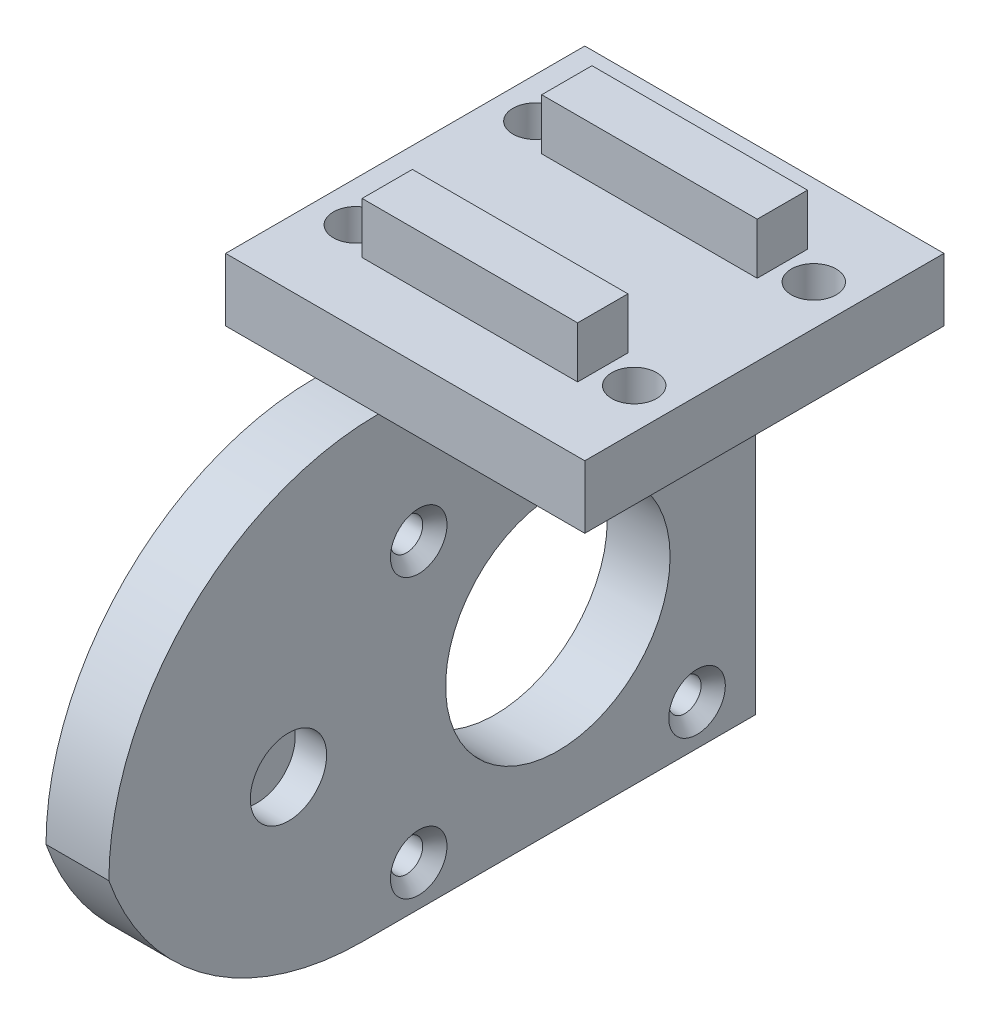
ISO-10303-21;
HEADER;
FILE_DESCRIPTION(('STEP AP214'),'2;1');
FILE_NAME('part.step','',(''),(''),'','','');
FILE_SCHEMA(('AUTOMOTIVE_DESIGN { 1 0 10303 214 1 1 1 1 }'));
ENDSEC;
DATA;
#1=APPLICATION_CONTEXT('core data for automotive mechanical design processes');
#2=APPLICATION_PROTOCOL_DEFINITION('international standard','automotive_design',2000,#1);
#3=PRODUCT_CONTEXT('',#1,'mechanical');
#4=PRODUCT('Part','Part','',(#3));
#5=PRODUCT_RELATED_PRODUCT_CATEGORY('part','',(#4));
#6=PRODUCT_DEFINITION_FORMATION('','',#4);
#7=PRODUCT_DEFINITION_CONTEXT('part definition',#1,'design');
#8=PRODUCT_DEFINITION('design','',#6,#7);
#9=PRODUCT_DEFINITION_SHAPE('','',#8);
#10=(LENGTH_UNIT() NAMED_UNIT(*) SI_UNIT(.MILLI.,.METRE.));
#11=(NAMED_UNIT(*) PLANE_ANGLE_UNIT() SI_UNIT($,.RADIAN.));
#12=(NAMED_UNIT(*) SI_UNIT($,.STERADIAN.) SOLID_ANGLE_UNIT());
#13=UNCERTAINTY_MEASURE_WITH_UNIT(LENGTH_MEASURE(1.E-05),#10,'distance_accuracy_value','');
#14=(GEOMETRIC_REPRESENTATION_CONTEXT(3) GLOBAL_UNCERTAINTY_ASSIGNED_CONTEXT((#13)) GLOBAL_UNIT_ASSIGNED_CONTEXT((#10,
#11,#12)) REPRESENTATION_CONTEXT('',''));
#15=CARTESIAN_POINT('',(0.,0.,0.));
#16=DIRECTION('',(0.,0.,1.));
#17=DIRECTION('',(1.,0.,0.));
#18=AXIS2_PLACEMENT_3D('',#15,#16,#17);
#19=CARTESIAN_POINT('',(0.,0.,0.));
#20=DIRECTION('',(0.,-1.,0.));
#21=DIRECTION('',(0.,0.,-1.));
#22=AXIS2_PLACEMENT_3D('',#19,#20,#21);
#23=PLANE('',#22);
#24=DIRECTION('',(0.,0.,-1.));
#25=VECTOR('',#24,1.);
#26=CARTESIAN_POINT('',(-10.,0.,50.));
#27=LINE('',#26,#25);
#28=CARTESIAN_POINT('',(-10.,0.,20.));
#29=VERTEX_POINT('',#28);
#30=CARTESIAN_POINT('',(-10.,0.,-20.));
#31=VERTEX_POINT('',#30);
#32=EDGE_CURVE('E324',#29,#31,#27,.T.);
#33=ORIENTED_EDGE('',*,*,#32,.F.);
#34=DIRECTION('',(1.,0.,0.));
#35=VECTOR('',#34,1.);
#36=CARTESIAN_POINT('',(20.,0.,20.));
#37=LINE('',#36,#35);
#38=CARTESIAN_POINT('',(-20.,0.,20.));
#39=VERTEX_POINT('',#38);
#40=EDGE_CURVE('E275',#39,#29,#37,.T.);
#41=ORIENTED_EDGE('',*,*,#40,.F.);
#42=DIRECTION('',(0.,0.,1.));
#43=VECTOR('',#42,1.);
#44=CARTESIAN_POINT('',(-20.,0.,-20.));
#45=LINE('',#44,#43);
#46=CARTESIAN_POINT('',(-20.,0.,-20.));
#47=VERTEX_POINT('',#46);
#48=EDGE_CURVE('E253',#47,#39,#45,.T.);
#49=ORIENTED_EDGE('',*,*,#48,.F.);
#50=DIRECTION('',(-1.,0.,0.));
#51=VECTOR('',#50,1.);
#52=CARTESIAN_POINT('',(20.,0.,-20.));
#53=LINE('',#52,#51);
#54=EDGE_CURVE('E281',#31,#47,#53,.T.);
#55=ORIENTED_EDGE('',*,*,#54,.F.);
#56=EDGE_LOOP('',(#33,#41,#49,#55));
#57=FACE_BOUND('',#56,.T.);
#58=CARTESIAN_POINT('',(-15.5,0.,-10.));
#59=DIRECTION('',(0.,-1.,0.));
#60=DIRECTION('',(0.,0.,-1.));
#61=AXIS2_PLACEMENT_3D('',#58,#59,#60);
#62=CIRCLE('',#61,2.5);
#63=CARTESIAN_POINT('',(-15.5,0.,-12.5));
#64=VERTEX_POINT('',#63);
#65=EDGE_CURVE('E208',#64,#64,#62,.F.);
#66=ORIENTED_EDGE('',*,*,#65,.T.);
#67=EDGE_LOOP('',(#66));
#68=FACE_BOUND('',#67,.T.);
#69=CARTESIAN_POINT('',(-15.5,0.,10.));
#70=DIRECTION('',(0.,-1.,0.));
#71=DIRECTION('',(0.,0.,-1.));
#72=AXIS2_PLACEMENT_3D('',#69,#70,#71);
#73=CIRCLE('',#72,2.5);
#74=CARTESIAN_POINT('',(-15.5,0.,7.50000000000001));
#75=VERTEX_POINT('',#74);
#76=EDGE_CURVE('E186',#75,#75,#73,.F.);
#77=ORIENTED_EDGE('',*,*,#76,.T.);
#78=EDGE_LOOP('',(#77));
#79=FACE_BOUND('',#78,.T.);
#80=ADVANCED_FACE('F37',(#57,#68,#79),#23,.T.);
#81=CARTESIAN_POINT('',(-20.,7.,-20.));
#82=DIRECTION('',(1.,0.,0.));
#83=DIRECTION('',(0.,0.,-1.));
#84=AXIS2_PLACEMENT_3D('',#81,#82,#83);
#85=PLANE('',#84);
#86=DIRECTION('',(0.,-1.,0.));
#87=VECTOR('',#86,1.);
#88=CARTESIAN_POINT('',(-20.,7.,20.));
#89=LINE('',#88,#87);
#90=CARTESIAN_POINT('',(-20.,7.,20.));
#91=VERTEX_POINT('',#90);
#92=EDGE_CURVE('E293',#91,#39,#89,.T.);
#93=ORIENTED_EDGE('',*,*,#92,.F.);
#94=DIRECTION('',(0.,0.,1.));
#95=VECTOR('',#94,1.);
#96=CARTESIAN_POINT('',(-20.,7.,-20.));
#97=LINE('',#96,#95);
#98=CARTESIAN_POINT('',(-20.,7.,-20.));
#99=VERTEX_POINT('',#98);
#100=EDGE_CURVE('E262',#99,#91,#97,.T.);
#101=ORIENTED_EDGE('',*,*,#100,.F.);
#102=DIRECTION('',(0.,-1.,0.));
#103=VECTOR('',#102,1.);
#104=CARTESIAN_POINT('',(-20.,7.,-20.));
#105=LINE('',#104,#103);
#106=EDGE_CURVE('E271',#99,#47,#105,.T.);
#107=ORIENTED_EDGE('',*,*,#106,.T.);
#108=ORIENTED_EDGE('',*,*,#48,.T.);
#109=EDGE_LOOP('',(#93,#101,#107,#108));
#110=FACE_BOUND('',#109,.T.);
#111=ADVANCED_FACE('F341',(#110),#85,.F.);
#112=CARTESIAN_POINT('',(20.,7.,20.));
#113=DIRECTION('',(0.,0.,-1.));
#114=DIRECTION('',(-1.,0.,0.));
#115=AXIS2_PLACEMENT_3D('',#112,#113,#114);
#116=PLANE('',#115);
#117=ORIENTED_EDGE('',*,*,#40,.T.);
#118=CARTESIAN_POINT('',(-3.00000000000001,0.,20.));
#119=VERTEX_POINT('',#118);
#120=EDGE_CURVE('E279',#29,#119,#37,.T.);
#121=ORIENTED_EDGE('',*,*,#120,.T.);
#122=CARTESIAN_POINT('',(20.,0.,20.));
#123=VERTEX_POINT('',#122);
#124=EDGE_CURVE('E274',#119,#123,#37,.T.);
#125=ORIENTED_EDGE('',*,*,#124,.T.);
#126=DIRECTION('',(0.,-1.,0.));
#127=VECTOR('',#126,1.);
#128=CARTESIAN_POINT('',(20.,7.,20.));
#129=LINE('',#128,#127);
#130=CARTESIAN_POINT('',(20.,7.,20.));
#131=VERTEX_POINT('',#130);
#132=EDGE_CURVE('E290',#131,#123,#129,.T.);
#133=ORIENTED_EDGE('',*,*,#132,.F.);
#134=DIRECTION('',(1.,0.,0.));
#135=VECTOR('',#134,1.);
#136=CARTESIAN_POINT('',(20.,7.,20.));
#137=LINE('',#136,#135);
#138=EDGE_CURVE('E264',#91,#131,#137,.T.);
#139=ORIENTED_EDGE('',*,*,#138,.F.);
#140=ORIENTED_EDGE('',*,*,#92,.T.);
#141=EDGE_LOOP('',(#117,#121,#125,#133,#139,#140));
#142=FACE_BOUND('',#141,.T.);
#143=ADVANCED_FACE('F348',(#142),#116,.F.);
#144=CARTESIAN_POINT('',(20.,7.,-20.));
#145=DIRECTION('',(-1.,0.,0.));
#146=DIRECTION('',(0.,0.,1.));
#147=AXIS2_PLACEMENT_3D('',#144,#145,#146);
#148=PLANE('',#147);
#149=DIRECTION('',(0.,-1.,0.));
#150=VECTOR('',#149,1.);
#151=CARTESIAN_POINT('',(20.,7.,-20.));
#152=LINE('',#151,#150);
#153=CARTESIAN_POINT('',(20.,7.,-20.));
#154=VERTEX_POINT('',#153);
#155=CARTESIAN_POINT('',(20.,0.,-20.));
#156=VERTEX_POINT('',#155);
#157=EDGE_CURVE('E287',#154,#156,#152,.T.);
#158=ORIENTED_EDGE('',*,*,#157,.F.);
#159=DIRECTION('',(0.,0.,-1.));
#160=VECTOR('',#159,1.);
#161=CARTESIAN_POINT('',(20.,7.,-20.));
#162=LINE('',#161,#160);
#163=EDGE_CURVE('E267',#131,#154,#162,.T.);
#164=ORIENTED_EDGE('',*,*,#163,.F.);
#165=ORIENTED_EDGE('',*,*,#132,.T.);
#166=DIRECTION('',(0.,0.,-1.));
#167=VECTOR('',#166,1.);
#168=CARTESIAN_POINT('',(20.,0.,-20.));
#169=LINE('',#168,#167);
#170=EDGE_CURVE('E278',#123,#156,#169,.T.);
#171=ORIENTED_EDGE('',*,*,#170,.T.);
#172=EDGE_LOOP('',(#158,#164,#165,#171));
#173=FACE_BOUND('',#172,.T.);
#174=ADVANCED_FACE('F490',(#173),#148,.F.);
#175=CARTESIAN_POINT('',(20.,7.,-20.));
#176=DIRECTION('',(0.,0.,1.));
#177=DIRECTION('',(1.,0.,0.));
#178=AXIS2_PLACEMENT_3D('',#175,#176,#177);
#179=PLANE('',#178);
#180=CARTESIAN_POINT('',(-3.00000000000001,0.,-20.));
#181=VERTEX_POINT('',#180);
#182=EDGE_CURVE('E265',#156,#181,#53,.T.);
#183=ORIENTED_EDGE('',*,*,#182,.T.);
#184=EDGE_CURVE('E284',#181,#31,#53,.T.);
#185=ORIENTED_EDGE('',*,*,#184,.T.);
#186=ORIENTED_EDGE('',*,*,#54,.T.);
#187=ORIENTED_EDGE('',*,*,#106,.F.);
#188=DIRECTION('',(-1.,0.,0.));
#189=VECTOR('',#188,1.);
#190=CARTESIAN_POINT('',(20.,7.,-20.));
#191=LINE('',#190,#189);
#192=EDGE_CURVE('E269',#154,#99,#191,.T.);
#193=ORIENTED_EDGE('',*,*,#192,.F.);
#194=ORIENTED_EDGE('',*,*,#157,.T.);
#195=EDGE_LOOP('',(#183,#185,#186,#187,#193,#194));
#196=FACE_BOUND('',#195,.T.);
#197=ADVANCED_FACE('F365',(#196),#179,.F.);
#198=CARTESIAN_POINT('',(0.,7.,0.));
#199=DIRECTION('',(0.,-1.,0.));
#200=DIRECTION('',(0.,0.,-1.));
#201=AXIS2_PLACEMENT_3D('',#198,#199,#200);
#202=PLANE('',#201);
#203=CARTESIAN_POINT('',(-15.5,7.,10.));
#204=DIRECTION('',(0.,1.,0.));
#205=DIRECTION('',(0.,0.,1.));
#206=AXIS2_PLACEMENT_3D('',#203,#204,#205);
#207=CIRCLE('',#206,2.5);
#208=CARTESIAN_POINT('',(-15.5,7.,12.5));
#209=VERTEX_POINT('',#208);
#210=EDGE_CURVE('E183',#209,#209,#207,.T.);
#211=ORIENTED_EDGE('',*,*,#210,.F.);
#212=EDGE_LOOP('',(#211));
#213=FACE_BOUND('',#212,.T.);
#214=CARTESIAN_POINT('',(15.5,7.,10.));
#215=DIRECTION('',(0.,1.,0.));
#216=DIRECTION('',(0.,0.,1.));
#217=AXIS2_PLACEMENT_3D('',#214,#215,#216);
#218=CIRCLE('',#217,2.5);
#219=CARTESIAN_POINT('',(15.5,7.,12.5));
#220=VERTEX_POINT('',#219);
#221=EDGE_CURVE('E199',#220,#220,#218,.T.);
#222=ORIENTED_EDGE('',*,*,#221,.F.);
#223=EDGE_LOOP('',(#222));
#224=FACE_BOUND('',#223,.T.);
#225=CARTESIAN_POINT('',(15.5,7.,-10.));
#226=DIRECTION('',(0.,1.,0.));
#227=DIRECTION('',(0.,0.,1.));
#228=AXIS2_PLACEMENT_3D('',#225,#226,#227);
#229=CIRCLE('',#228,2.49999999999999);
#230=CARTESIAN_POINT('',(15.5,7.,-7.5));
#231=VERTEX_POINT('',#230);
#232=EDGE_CURVE('E191',#231,#231,#229,.T.);
#233=ORIENTED_EDGE('',*,*,#232,.F.);
#234=EDGE_LOOP('',(#233));
#235=FACE_BOUND('',#234,.T.);
#236=CARTESIAN_POINT('',(-15.5,7.,-10.));
#237=DIRECTION('',(0.,1.,0.));
#238=DIRECTION('',(0.,0.,1.));
#239=AXIS2_PLACEMENT_3D('',#236,#237,#238);
#240=CIRCLE('',#239,2.5);
#241=CARTESIAN_POINT('',(-15.5,7.,-7.5));
#242=VERTEX_POINT('',#241);
#243=EDGE_CURVE('E198',#242,#242,#240,.T.);
#244=ORIENTED_EDGE('',*,*,#243,.F.);
#245=EDGE_LOOP('',(#244));
#246=FACE_BOUND('',#245,.T.);
#247=DIRECTION('',(0.,0.,-1.));
#248=VECTOR('',#247,1.);
#249=CARTESIAN_POINT('',(-12.,7.,-20.));
#250=LINE('',#249,#248);
#251=CARTESIAN_POINT('',(-12.,7.,12.8));
#252=VERTEX_POINT('',#251);
#253=CARTESIAN_POINT('',(-12.,7.,7.2));
#254=VERTEX_POINT('',#253);
#255=EDGE_CURVE('E219',#252,#254,#250,.T.);
#256=ORIENTED_EDGE('',*,*,#255,.T.);
#257=DIRECTION('',(-1.,0.,0.));
#258=VECTOR('',#257,1.);
#259=CARTESIAN_POINT('',(27.9906195003892,7.,7.19999999999999));
#260=LINE('',#259,#258);
#261=CARTESIAN_POINT('',(12.,7.,7.19999999999999));
#262=VERTEX_POINT('',#261);
#263=EDGE_CURVE('E237',#262,#254,#260,.T.);
#264=ORIENTED_EDGE('',*,*,#263,.F.);
#265=DIRECTION('',(0.,0.,1.));
#266=VECTOR('',#265,1.);
#267=CARTESIAN_POINT('',(12.,7.,-20.));
#268=LINE('',#267,#266);
#269=CARTESIAN_POINT('',(12.,7.,12.8));
#270=VERTEX_POINT('',#269);
#271=EDGE_CURVE('E222',#262,#270,#268,.T.);
#272=ORIENTED_EDGE('',*,*,#271,.T.);
#273=DIRECTION('',(-1.,0.,0.));
#274=VECTOR('',#273,1.);
#275=CARTESIAN_POINT('',(27.9906195003892,7.,12.8));
#276=LINE('',#275,#274);
#277=EDGE_CURVE('E245',#270,#252,#276,.T.);
#278=ORIENTED_EDGE('',*,*,#277,.T.);
#279=EDGE_LOOP('',(#256,#264,#272,#278));
#280=FACE_BOUND('',#279,.T.);
#281=CARTESIAN_POINT('',(-12.,7.,-7.2));
#282=VERTEX_POINT('',#281);
#283=CARTESIAN_POINT('',(-12.,7.,-12.8));
#284=VERTEX_POINT('',#283);
#285=EDGE_CURVE('E216',#282,#284,#250,.T.);
#286=ORIENTED_EDGE('',*,*,#285,.T.);
#287=DIRECTION('',(-1.,0.,0.));
#288=VECTOR('',#287,1.);
#289=CARTESIAN_POINT('',(27.9906195003892,7.,-12.8));
#290=LINE('',#289,#288);
#291=CARTESIAN_POINT('',(12.,7.,-12.8));
#292=VERTEX_POINT('',#291);
#293=EDGE_CURVE('E254',#292,#284,#290,.T.);
#294=ORIENTED_EDGE('',*,*,#293,.F.);
#295=CARTESIAN_POINT('',(12.,7.,-7.20000000000001));
#296=VERTEX_POINT('',#295);
#297=EDGE_CURVE('E215',#292,#296,#268,.T.);
#298=ORIENTED_EDGE('',*,*,#297,.T.);
#299=DIRECTION('',(-1.,0.,0.));
#300=VECTOR('',#299,1.);
#301=CARTESIAN_POINT('',(27.9906195003892,7.,-7.20000000000001));
#302=LINE('',#301,#300);
#303=EDGE_CURVE('E250',#296,#282,#302,.T.);
#304=ORIENTED_EDGE('',*,*,#303,.T.);
#305=EDGE_LOOP('',(#286,#294,#298,#304));
#306=FACE_BOUND('',#305,.T.);
#307=ORIENTED_EDGE('',*,*,#192,.T.);
#308=ORIENTED_EDGE('',*,*,#100,.T.);
#309=ORIENTED_EDGE('',*,*,#138,.T.);
#310=ORIENTED_EDGE('',*,*,#163,.T.);
#311=EDGE_LOOP('',(#307,#308,#309,#310));
#312=FACE_BOUND('',#311,.T.);
#313=ADVANCED_FACE('F356',(#213,#224,#235,#246,#280,#306,#312),#202,.F.);
#314=DIRECTION('',(0.,0.,1.));
#315=VECTOR('',#314,1.);
#316=CARTESIAN_POINT('',(-3.00000000000001,0.,50.));
#317=LINE('',#316,#315);
#318=EDGE_CURVE('E300',#181,#119,#317,.T.);
#319=ORIENTED_EDGE('',*,*,#318,.F.);
#320=ORIENTED_EDGE('',*,*,#182,.F.);
#321=ORIENTED_EDGE('',*,*,#170,.F.);
#322=ORIENTED_EDGE('',*,*,#124,.F.);
#323=EDGE_LOOP('',(#319,#320,#321,#322));
#324=FACE_BOUND('',#323,.T.);
#325=CARTESIAN_POINT('',(15.5,0.,10.));
#326=DIRECTION('',(0.,-1.,0.));
#327=DIRECTION('',(0.,0.,-1.));
#328=AXIS2_PLACEMENT_3D('',#325,#326,#327);
#329=CIRCLE('',#328,2.5);
#330=CARTESIAN_POINT('',(15.5,0.,7.50000000000001));
#331=VERTEX_POINT('',#330);
#332=EDGE_CURVE('E195',#331,#331,#329,.F.);
#333=ORIENTED_EDGE('',*,*,#332,.T.);
#334=EDGE_LOOP('',(#333));
#335=FACE_BOUND('',#334,.T.);
#336=CARTESIAN_POINT('',(15.5,0.,-10.));
#337=DIRECTION('',(0.,-1.,0.));
#338=DIRECTION('',(0.,0.,-1.));
#339=AXIS2_PLACEMENT_3D('',#336,#337,#338);
#340=CIRCLE('',#339,2.49999999999999);
#341=CARTESIAN_POINT('',(15.5,0.,-12.5));
#342=VERTEX_POINT('',#341);
#343=EDGE_CURVE('E194',#342,#342,#340,.F.);
#344=ORIENTED_EDGE('',*,*,#343,.T.);
#345=EDGE_LOOP('',(#344));
#346=FACE_BOUND('',#345,.T.);
#347=ADVANCED_FACE('F344',(#324,#335,#346),#23,.T.);
#348=CARTESIAN_POINT('',(27.9906195003892,7.,-7.20000000000001));
#349=DIRECTION('',(0.,0.,1.));
#350=DIRECTION('',(1.,0.,0.));
#351=AXIS2_PLACEMENT_3D('',#348,#349,#350);
#352=PLANE('',#351);
#353=DIRECTION('',(0.,1.,0.));
#354=VECTOR('',#353,1.);
#355=CARTESIAN_POINT('',(-12.,7.,-7.2));
#356=LINE('',#355,#354);
#357=CARTESIAN_POINT('',(-12.,12.7,-7.2));
#358=VERTEX_POINT('',#357);
#359=EDGE_CURVE('E235',#282,#358,#356,.T.);
#360=ORIENTED_EDGE('',*,*,#359,.F.);
#361=ORIENTED_EDGE('',*,*,#303,.F.);
#362=DIRECTION('',(0.,-1.,0.));
#363=VECTOR('',#362,1.);
#364=CARTESIAN_POINT('',(12.,7.,-7.20000000000001));
#365=LINE('',#364,#363);
#366=CARTESIAN_POINT('',(12.,12.7,-7.2));
#367=VERTEX_POINT('',#366);
#368=EDGE_CURVE('E229',#367,#296,#365,.T.);
#369=ORIENTED_EDGE('',*,*,#368,.F.);
#370=DIRECTION('',(-1.,0.,0.));
#371=VECTOR('',#370,1.);
#372=CARTESIAN_POINT('',(27.9906195003892,12.7,-7.20000000000001));
#373=LINE('',#372,#371);
#374=EDGE_CURVE('E241',#367,#358,#373,.T.);
#375=ORIENTED_EDGE('',*,*,#374,.T.);
#376=EDGE_LOOP('',(#360,#361,#369,#375));
#377=FACE_BOUND('',#376,.T.);
#378=ADVANCED_FACE('F355',(#377),#352,.T.);
#379=CARTESIAN_POINT('',(27.9906195003892,7.,-12.8));
#380=DIRECTION('',(0.,0.,-1.));
#381=DIRECTION('',(0.,1.,0.));
#382=AXIS2_PLACEMENT_3D('',#379,#380,#381);
#383=PLANE('',#382);
#384=DIRECTION('',(0.,-1.,0.));
#385=VECTOR('',#384,1.);
#386=CARTESIAN_POINT('',(-12.,7.,-12.8));
#387=LINE('',#386,#385);
#388=CARTESIAN_POINT('',(-12.,12.7,-12.8));
#389=VERTEX_POINT('',#388);
#390=EDGE_CURVE('E233',#389,#284,#387,.T.);
#391=ORIENTED_EDGE('',*,*,#390,.F.);
#392=DIRECTION('',(-1.,0.,0.));
#393=VECTOR('',#392,1.);
#394=CARTESIAN_POINT('',(27.9906195003892,12.7,-12.8));
#395=LINE('',#394,#393);
#396=CARTESIAN_POINT('',(12.,12.7,-12.8));
#397=VERTEX_POINT('',#396);
#398=EDGE_CURVE('E257',#397,#389,#395,.T.);
#399=ORIENTED_EDGE('',*,*,#398,.F.);
#400=DIRECTION('',(0.,1.,0.));
#401=VECTOR('',#400,1.);
#402=CARTESIAN_POINT('',(12.,7.,-12.8));
#403=LINE('',#402,#401);
#404=EDGE_CURVE('E227',#292,#397,#403,.T.);
#405=ORIENTED_EDGE('',*,*,#404,.F.);
#406=ORIENTED_EDGE('',*,*,#293,.T.);
#407=EDGE_LOOP('',(#391,#399,#405,#406));
#408=FACE_BOUND('',#407,.T.);
#409=ADVANCED_FACE('F362',(#408),#383,.T.);
#410=CARTESIAN_POINT('',(27.9906195003892,12.7,-7.20000000000001));
#411=DIRECTION('',(0.,1.,0.));
#412=DIRECTION('',(0.,0.,1.));
#413=AXIS2_PLACEMENT_3D('',#410,#411,#412);
#414=PLANE('',#413);
#415=DIRECTION('',(0.,0.,-1.));
#416=VECTOR('',#415,1.);
#417=CARTESIAN_POINT('',(-12.,12.7,-20.));
#418=LINE('',#417,#416);
#419=EDGE_CURVE('E212',#358,#389,#418,.T.);
#420=ORIENTED_EDGE('',*,*,#419,.F.);
#421=ORIENTED_EDGE('',*,*,#374,.F.);
#422=DIRECTION('',(0.,0.,1.));
#423=VECTOR('',#422,1.);
#424=CARTESIAN_POINT('',(12.,12.7,-20.));
#425=LINE('',#424,#423);
#426=EDGE_CURVE('E221',#397,#367,#425,.T.);
#427=ORIENTED_EDGE('',*,*,#426,.F.);
#428=ORIENTED_EDGE('',*,*,#398,.T.);
#429=EDGE_LOOP('',(#420,#421,#427,#428));
#430=FACE_BOUND('',#429,.T.);
#431=ADVANCED_FACE('F418',(#430),#414,.T.);
#432=CARTESIAN_POINT('',(27.9906195003892,7.,7.19999999999999));
#433=DIRECTION('',(0.,0.,-1.));
#434=DIRECTION('',(-1.,0.,0.));
#435=AXIS2_PLACEMENT_3D('',#432,#433,#434);
#436=PLANE('',#435);
#437=DIRECTION('',(0.,-1.,0.));
#438=VECTOR('',#437,1.);
#439=CARTESIAN_POINT('',(-12.,7.,7.2));
#440=LINE('',#439,#438);
#441=CARTESIAN_POINT('',(-12.,12.7,7.19999999999999));
#442=VERTEX_POINT('',#441);
#443=EDGE_CURVE('E231',#442,#254,#440,.T.);
#444=ORIENTED_EDGE('',*,*,#443,.F.);
#445=DIRECTION('',(-1.,0.,0.));
#446=VECTOR('',#445,1.);
#447=CARTESIAN_POINT('',(27.9906195003892,12.7,7.19999999999999));
#448=LINE('',#447,#446);
#449=CARTESIAN_POINT('',(12.,12.7,7.19999999999999));
#450=VERTEX_POINT('',#449);
#451=EDGE_CURVE('E238',#450,#442,#448,.T.);
#452=ORIENTED_EDGE('',*,*,#451,.F.);
#453=DIRECTION('',(0.,1.,0.));
#454=VECTOR('',#453,1.);
#455=CARTESIAN_POINT('',(12.,7.,7.2));
#456=LINE('',#455,#454);
#457=EDGE_CURVE('E225',#262,#450,#456,.T.);
#458=ORIENTED_EDGE('',*,*,#457,.F.);
#459=ORIENTED_EDGE('',*,*,#263,.T.);
#460=EDGE_LOOP('',(#444,#452,#458,#459));
#461=FACE_BOUND('',#460,.T.);
#462=ADVANCED_FACE('F411',(#461),#436,.T.);
#463=CARTESIAN_POINT('',(27.9906195003892,12.7,7.19999999999999));
#464=DIRECTION('',(0.,1.,0.));
#465=DIRECTION('',(0.,0.,1.));
#466=AXIS2_PLACEMENT_3D('',#463,#464,#465);
#467=PLANE('',#466);
#468=CARTESIAN_POINT('',(-12.,12.7,12.8));
#469=VERTEX_POINT('',#468);
#470=EDGE_CURVE('E214',#469,#442,#418,.T.);
#471=ORIENTED_EDGE('',*,*,#470,.F.);
#472=DIRECTION('',(-1.,0.,0.));
#473=VECTOR('',#472,1.);
#474=CARTESIAN_POINT('',(27.9906195003892,12.7,12.8));
#475=LINE('',#474,#473);
#476=CARTESIAN_POINT('',(12.,12.7,12.8));
#477=VERTEX_POINT('',#476);
#478=EDGE_CURVE('E242',#477,#469,#475,.T.);
#479=ORIENTED_EDGE('',*,*,#478,.F.);
#480=EDGE_CURVE('E211',#450,#477,#425,.T.);
#481=ORIENTED_EDGE('',*,*,#480,.F.);
#482=ORIENTED_EDGE('',*,*,#451,.T.);
#483=EDGE_LOOP('',(#471,#479,#481,#482));
#484=FACE_BOUND('',#483,.T.);
#485=ADVANCED_FACE('F408',(#484),#467,.T.);
#486=CARTESIAN_POINT('',(27.9906195003892,7.,12.8));
#487=DIRECTION('',(0.,0.,1.));
#488=DIRECTION('',(1.,0.,0.));
#489=AXIS2_PLACEMENT_3D('',#486,#487,#488);
#490=PLANE('',#489);
#491=DIRECTION('',(0.,1.,0.));
#492=VECTOR('',#491,1.);
#493=CARTESIAN_POINT('',(-12.,7.,12.8));
#494=LINE('',#493,#492);
#495=EDGE_CURVE('E298',#252,#469,#494,.T.);
#496=ORIENTED_EDGE('',*,*,#495,.F.);
#497=ORIENTED_EDGE('',*,*,#277,.F.);
#498=DIRECTION('',(0.,-1.,0.));
#499=VECTOR('',#498,1.);
#500=CARTESIAN_POINT('',(12.,7.,12.8));
#501=LINE('',#500,#499);
#502=EDGE_CURVE('E296',#477,#270,#501,.T.);
#503=ORIENTED_EDGE('',*,*,#502,.F.);
#504=ORIENTED_EDGE('',*,*,#478,.T.);
#505=EDGE_LOOP('',(#496,#497,#503,#504));
#506=FACE_BOUND('',#505,.T.);
#507=ADVANCED_FACE('F406',(#506),#490,.T.);
#508=CARTESIAN_POINT('',(12.,-33.7921561087423,-20.));
#509=DIRECTION('',(-1.,0.,0.));
#510=DIRECTION('',(0.,0.,1.));
#511=AXIS2_PLACEMENT_3D('',#508,#509,#510);
#512=PLANE('',#511);
#513=ORIENTED_EDGE('',*,*,#457,.T.);
#514=ORIENTED_EDGE('',*,*,#480,.T.);
#515=ORIENTED_EDGE('',*,*,#502,.T.);
#516=ORIENTED_EDGE('',*,*,#271,.F.);
#517=EDGE_LOOP('',(#513,#514,#515,#516));
#518=FACE_BOUND('',#517,.T.);
#519=ADVANCED_FACE('F402',(#518),#512,.F.);
#520=CARTESIAN_POINT('',(-12.,-33.7921561087423,-20.));
#521=DIRECTION('',(1.,0.,0.));
#522=DIRECTION('',(0.,0.,-1.));
#523=AXIS2_PLACEMENT_3D('',#520,#521,#522);
#524=PLANE('',#523);
#525=ORIENTED_EDGE('',*,*,#443,.T.);
#526=ORIENTED_EDGE('',*,*,#255,.F.);
#527=ORIENTED_EDGE('',*,*,#495,.T.);
#528=ORIENTED_EDGE('',*,*,#470,.T.);
#529=EDGE_LOOP('',(#525,#526,#527,#528));
#530=FACE_BOUND('',#529,.T.);
#531=ADVANCED_FACE('F398',(#530),#524,.F.);
#532=ORIENTED_EDGE('',*,*,#368,.T.);
#533=ORIENTED_EDGE('',*,*,#297,.F.);
#534=ORIENTED_EDGE('',*,*,#404,.T.);
#535=ORIENTED_EDGE('',*,*,#426,.T.);
#536=EDGE_LOOP('',(#532,#533,#534,#535));
#537=FACE_BOUND('',#536,.T.);
#538=ADVANCED_FACE('F401',(#537),#512,.F.);
#539=ORIENTED_EDGE('',*,*,#359,.T.);
#540=ORIENTED_EDGE('',*,*,#419,.T.);
#541=ORIENTED_EDGE('',*,*,#390,.T.);
#542=ORIENTED_EDGE('',*,*,#285,.F.);
#543=EDGE_LOOP('',(#539,#540,#541,#542));
#544=FACE_BOUND('',#543,.T.);
#545=ADVANCED_FACE('F388',(#544),#524,.F.);
#546=CARTESIAN_POINT('',(-15.5,-7.07106781186548,-10.));
#547=DIRECTION('',(0.,1.,0.));
#548=DIRECTION('',(0.,0.,1.));
#549=AXIS2_PLACEMENT_3D('',#546,#547,#548);
#550=CYLINDRICAL_SURFACE('',#549,2.5);
#551=ORIENTED_EDGE('',*,*,#243,.T.);
#552=EDGE_LOOP('',(#551));
#553=FACE_BOUND('',#552,.T.);
#554=ORIENTED_EDGE('',*,*,#65,.F.);
#555=EDGE_LOOP('',(#554));
#556=FACE_BOUND('',#555,.T.);
#557=ADVANCED_FACE('F378',(#553,#556),#550,.F.);
#558=CARTESIAN_POINT('',(15.5,-7.07106781186548,-10.));
#559=DIRECTION('',(0.,1.,0.));
#560=DIRECTION('',(0.,0.,1.));
#561=AXIS2_PLACEMENT_3D('',#558,#559,#560);
#562=CYLINDRICAL_SURFACE('',#561,2.49999999999999);
#563=ORIENTED_EDGE('',*,*,#232,.T.);
#564=EDGE_LOOP('',(#563));
#565=FACE_BOUND('',#564,.T.);
#566=ORIENTED_EDGE('',*,*,#343,.F.);
#567=EDGE_LOOP('',(#566));
#568=FACE_BOUND('',#567,.T.);
#569=ADVANCED_FACE('F375',(#565,#568),#562,.F.);
#570=CARTESIAN_POINT('',(15.5,-7.07106781186548,10.));
#571=DIRECTION('',(0.,1.,0.));
#572=DIRECTION('',(0.,0.,1.));
#573=AXIS2_PLACEMENT_3D('',#570,#571,#572);
#574=CYLINDRICAL_SURFACE('',#573,2.5);
#575=ORIENTED_EDGE('',*,*,#221,.T.);
#576=EDGE_LOOP('',(#575));
#577=FACE_BOUND('',#576,.T.);
#578=ORIENTED_EDGE('',*,*,#332,.F.);
#579=EDGE_LOOP('',(#578));
#580=FACE_BOUND('',#579,.T.);
#581=ADVANCED_FACE('F377',(#577,#580),#574,.F.);
#582=CARTESIAN_POINT('',(-15.5,-7.07106781186548,10.));
#583=DIRECTION('',(0.,1.,0.));
#584=DIRECTION('',(0.,0.,1.));
#585=AXIS2_PLACEMENT_3D('',#582,#583,#584);
#586=CYLINDRICAL_SURFACE('',#585,2.5);
#587=ORIENTED_EDGE('',*,*,#210,.T.);
#588=EDGE_LOOP('',(#587));
#589=FACE_BOUND('',#588,.T.);
#590=ORIENTED_EDGE('',*,*,#76,.F.);
#591=EDGE_LOOP('',(#590));
#592=FACE_BOUND('',#591,.T.);
#593=ADVANCED_FACE('F385',(#589,#592),#586,.F.);
#594=CARTESIAN_POINT('',(0.,0.,0.));
#595=DIRECTION('',(0.,1.,0.));
#596=DIRECTION('',(0.,0.,1.));
#597=AXIS2_PLACEMENT_3D('',#594,#595,#596);
#598=PLANE('',#597);
#599=ORIENTED_EDGE('',*,*,#184,.F.);
#600=CARTESIAN_POINT('',(-3.,0.,-22.));
#601=VERTEX_POINT('',#600);
#602=EDGE_CURVE('E168',#601,#181,#317,.T.);
#603=ORIENTED_EDGE('',*,*,#602,.F.);
#604=DIRECTION('',(1.,0.,0.));
#605=VECTOR('',#604,1.);
#606=CARTESIAN_POINT('',(-3.,0.,-22.));
#607=LINE('',#606,#605);
#608=CARTESIAN_POINT('',(-10.,0.,-22.));
#609=VERTEX_POINT('',#608);
#610=EDGE_CURVE('E776',#609,#601,#607,.T.);
#611=ORIENTED_EDGE('',*,*,#610,.F.);
#612=EDGE_CURVE('E181',#31,#609,#27,.T.);
#613=ORIENTED_EDGE('',*,*,#612,.F.);
#614=EDGE_LOOP('',(#599,#603,#611,#613));
#615=FACE_BOUND('',#614,.T.);
#616=ADVANCED_FACE('F395',(#615),#598,.T.);
#617=CARTESIAN_POINT('',(-10.,-50.,50.));
#618=DIRECTION('',(1.,0.,0.));
#619=DIRECTION('',(0.,0.,-1.));
#620=AXIS2_PLACEMENT_3D('',#617,#618,#619);
#621=PLANE('',#620);
#622=CARTESIAN_POINT('',(-10.,-14.5,15.5));
#623=DIRECTION('',(1.,0.,0.));
#624=DIRECTION('',(0.,0.,-1.));
#625=AXIS2_PLACEMENT_3D('',#622,#623,#624);
#626=CIRCLE('',#625,1.8);
#627=CARTESIAN_POINT('',(-10.,-14.5,13.7));
#628=VERTEX_POINT('',#627);
#629=EDGE_CURVE('E316',#628,#628,#626,.T.);
#630=ORIENTED_EDGE('',*,*,#629,.T.);
#631=EDGE_LOOP('',(#630));
#632=FACE_BOUND('',#631,.T.);
#633=CARTESIAN_POINT('',(-10.,-14.5,-15.5));
#634=DIRECTION('',(1.,0.,0.));
#635=DIRECTION('',(0.,0.,-1.));
#636=AXIS2_PLACEMENT_3D('',#633,#634,#635);
#637=CIRCLE('',#636,1.8);
#638=CARTESIAN_POINT('',(-10.,-14.5,-17.3));
#639=VERTEX_POINT('',#638);
#640=EDGE_CURVE('E311',#639,#639,#637,.T.);
#641=ORIENTED_EDGE('',*,*,#640,.T.);
#642=EDGE_LOOP('',(#641));
#643=FACE_BOUND('',#642,.T.);
#644=CARTESIAN_POINT('',(-10.,-45.5,-15.5));
#645=DIRECTION('',(1.,0.,0.));
#646=DIRECTION('',(0.,0.,-1.));
#647=AXIS2_PLACEMENT_3D('',#644,#645,#646);
#648=CIRCLE('',#647,1.8);
#649=CARTESIAN_POINT('',(-10.,-45.5,-17.3));
#650=VERTEX_POINT('',#649);
#651=EDGE_CURVE('E306',#650,#650,#648,.T.);
#652=ORIENTED_EDGE('',*,*,#651,.T.);
#653=EDGE_LOOP('',(#652));
#654=FACE_BOUND('',#653,.T.);
#655=CARTESIAN_POINT('',(-10.,-45.5,15.5));
#656=DIRECTION('',(1.,0.,0.));
#657=DIRECTION('',(0.,0.,-1.));
#658=AXIS2_PLACEMENT_3D('',#655,#656,#657);
#659=CIRCLE('',#658,1.8);
#660=CARTESIAN_POINT('',(-10.,-45.5,13.7));
#661=VERTEX_POINT('',#660);
#662=EDGE_CURVE('E301',#661,#661,#659,.T.);
#663=ORIENTED_EDGE('',*,*,#662,.T.);
#664=EDGE_LOOP('',(#663));
#665=FACE_BOUND('',#664,.T.);
#666=CARTESIAN_POINT('',(-10.,-30.,0.));
#667=DIRECTION('',(1.,0.,0.));
#668=DIRECTION('',(0.,0.,-1.));
#669=AXIS2_PLACEMENT_3D('',#666,#667,#668);
#670=CIRCLE('',#669,12.5);
#671=CARTESIAN_POINT('',(-10.,-30.,-12.5));
#672=VERTEX_POINT('',#671);
#673=EDGE_CURVE('E780',#672,#672,#670,.F.);
#674=ORIENTED_EDGE('',*,*,#673,.F.);
#675=EDGE_LOOP('',(#674));
#676=FACE_BOUND('',#675,.T.);
#677=DIRECTION('',(0.,0.,-1.));
#678=VECTOR('',#677,1.);
#679=CARTESIAN_POINT('',(-10.,-50.,50.));
#680=LINE('',#679,#678);
#681=CARTESIAN_POINT('',(-10.,-50.,21.7157287525381));
#682=VERTEX_POINT('',#681);
#683=CARTESIAN_POINT('',(-10.,-50.,-22.));
#684=VERTEX_POINT('',#683);
#685=EDGE_CURVE('E160',#682,#684,#680,.T.);
#686=ORIENTED_EDGE('',*,*,#685,.F.);
#687=CARTESIAN_POINT('',(-10.,-20.,21.7157287525381));
#688=DIRECTION('',(1.,0.,0.));
#689=DIRECTION('',(0.,0.,-1.));
#690=AXIS2_PLACEMENT_3D('',#687,#688,#689);
#691=CIRCLE('',#690,30.);
#692=CARTESIAN_POINT('',(-10.,-30.,50.));
#693=VERTEX_POINT('',#692);
#694=EDGE_CURVE('E45',#682,#693,#691,.F.);
#695=ORIENTED_EDGE('',*,*,#694,.T.);
#696=CARTESIAN_POINT('',(-10.,-30.,20.));
#697=DIRECTION('',(1.,0.,0.));
#698=DIRECTION('',(0.,0.,-1.));
#699=AXIS2_PLACEMENT_3D('',#696,#697,#698);
#700=CIRCLE('',#699,30.);
#701=EDGE_CURVE('E323',#693,#29,#700,.F.);
#702=ORIENTED_EDGE('',*,*,#701,.T.);
#703=ORIENTED_EDGE('',*,*,#32,.T.);
#704=ORIENTED_EDGE('',*,*,#612,.T.);
#705=DIRECTION('',(0.,1.,0.));
#706=VECTOR('',#705,1.);
#707=CARTESIAN_POINT('',(-10.,-50.,-22.));
#708=LINE('',#707,#706);
#709=EDGE_CURVE('E173',#684,#609,#708,.T.);
#710=ORIENTED_EDGE('',*,*,#709,.F.);
#711=EDGE_LOOP('',(#686,#695,#702,#703,#704,#710));
#712=FACE_BOUND('',#711,.T.);
#713=ADVANCED_FACE('F178',(#632,#643,#654,#665,#676,#712),#621,.F.);
#714=CARTESIAN_POINT('',(-3.,-50.,-22.));
#715=DIRECTION('',(0.,0.,1.));
#716=DIRECTION('',(1.,0.,0.));
#717=AXIS2_PLACEMENT_3D('',#714,#715,#716);
#718=PLANE('',#717);
#719=ORIENTED_EDGE('',*,*,#610,.T.);
#720=DIRECTION('',(0.,1.,0.));
#721=VECTOR('',#720,1.);
#722=CARTESIAN_POINT('',(-3.,-50.,-22.));
#723=LINE('',#722,#721);
#724=CARTESIAN_POINT('',(-3.,-50.,-22.));
#725=VERTEX_POINT('',#724);
#726=EDGE_CURVE('E175',#725,#601,#723,.T.);
#727=ORIENTED_EDGE('',*,*,#726,.F.);
#728=DIRECTION('',(1.,0.,0.));
#729=VECTOR('',#728,1.);
#730=CARTESIAN_POINT('',(-3.,-50.,-22.));
#731=LINE('',#730,#729);
#732=EDGE_CURVE('E163',#684,#725,#731,.T.);
#733=ORIENTED_EDGE('',*,*,#732,.F.);
#734=ORIENTED_EDGE('',*,*,#709,.T.);
#735=EDGE_LOOP('',(#719,#727,#733,#734));
#736=FACE_BOUND('',#735,.T.);
#737=ADVANCED_FACE('F172',(#736),#718,.F.);
#738=CARTESIAN_POINT('',(-3.00000000000001,-50.,50.));
#739=DIRECTION('',(-1.,0.,0.));
#740=DIRECTION('',(0.,0.,1.));
#741=AXIS2_PLACEMENT_3D('',#738,#739,#740);
#742=PLANE('',#741);
#743=CARTESIAN_POINT('',(-3.00000000000001,-30.,30.));
#744=DIRECTION('',(1.,0.,0.));
#745=DIRECTION('',(0.,0.,-1.));
#746=AXIS2_PLACEMENT_3D('',#743,#744,#745);
#747=CIRCLE('',#746,4.25);
#748=CARTESIAN_POINT('',(-3.00000000000001,-30.,25.75));
#749=VERTEX_POINT('',#748);
#750=EDGE_CURVE('E805',#749,#749,#747,.T.);
#751=ORIENTED_EDGE('',*,*,#750,.F.);
#752=EDGE_LOOP('',(#751));
#753=FACE_BOUND('',#752,.T.);
#754=CARTESIAN_POINT('',(-3.00000000000001,-14.5,15.5));
#755=DIRECTION('',(1.,0.,0.));
#756=DIRECTION('',(0.,0.,-1.));
#757=AXIS2_PLACEMENT_3D('',#754,#755,#756);
#758=CIRCLE('',#757,3.15);
#759=CARTESIAN_POINT('',(-3.00000000000001,-14.5,12.35));
#760=VERTEX_POINT('',#759);
#761=EDGE_CURVE('E801',#760,#760,#758,.T.);
#762=ORIENTED_EDGE('',*,*,#761,.F.);
#763=EDGE_LOOP('',(#762));
#764=FACE_BOUND('',#763,.T.);
#765=CARTESIAN_POINT('',(-3.,-14.5,-15.5));
#766=DIRECTION('',(1.,0.,0.));
#767=DIRECTION('',(0.,0.,-1.));
#768=AXIS2_PLACEMENT_3D('',#765,#766,#767);
#769=CIRCLE('',#768,3.15);
#770=CARTESIAN_POINT('',(-3.,-14.5,-18.65));
#771=VERTEX_POINT('',#770);
#772=EDGE_CURVE('E319',#771,#771,#769,.T.);
#773=ORIENTED_EDGE('',*,*,#772,.F.);
#774=EDGE_LOOP('',(#773));
#775=FACE_BOUND('',#774,.T.);
#776=CARTESIAN_POINT('',(-3.,-45.5,-15.5));
#777=DIRECTION('',(1.,0.,0.));
#778=DIRECTION('',(0.,0.,-1.));
#779=AXIS2_PLACEMENT_3D('',#776,#777,#778);
#780=CIRCLE('',#779,3.15);
#781=CARTESIAN_POINT('',(-3.,-45.5,-18.65));
#782=VERTEX_POINT('',#781);
#783=EDGE_CURVE('E314',#782,#782,#780,.T.);
#784=ORIENTED_EDGE('',*,*,#783,.F.);
#785=EDGE_LOOP('',(#784));
#786=FACE_BOUND('',#785,.T.);
#787=CARTESIAN_POINT('',(-3.00000000000001,-45.5,15.5));
#788=DIRECTION('',(1.,0.,0.));
#789=DIRECTION('',(0.,0.,-1.));
#790=AXIS2_PLACEMENT_3D('',#787,#788,#789);
#791=CIRCLE('',#790,3.15);
#792=CARTESIAN_POINT('',(-3.00000000000001,-45.5,12.35));
#793=VERTEX_POINT('',#792);
#794=EDGE_CURVE('E309',#793,#793,#791,.T.);
#795=ORIENTED_EDGE('',*,*,#794,.F.);
#796=EDGE_LOOP('',(#795));
#797=FACE_BOUND('',#796,.T.);
#798=CARTESIAN_POINT('',(-3.00000000000001,-30.,0.));
#799=DIRECTION('',(1.,0.,0.));
#800=DIRECTION('',(0.,0.,-1.));
#801=AXIS2_PLACEMENT_3D('',#798,#799,#800);
#802=CIRCLE('',#801,12.5);
#803=CARTESIAN_POINT('',(-3.,-30.,-12.5));
#804=VERTEX_POINT('',#803);
#805=EDGE_CURVE('E304',#804,#804,#802,.T.);
#806=ORIENTED_EDGE('',*,*,#805,.F.);
#807=EDGE_LOOP('',(#806));
#808=FACE_BOUND('',#807,.T.);
#809=CARTESIAN_POINT('',(-3.00000000000001,-30.,20.));
#810=DIRECTION('',(-1.,0.,0.));
#811=DIRECTION('',(0.,0.,1.));
#812=AXIS2_PLACEMENT_3D('',#809,#810,#811);
#813=CIRCLE('',#812,30.);
#814=CARTESIAN_POINT('',(-3.00000000000001,-30.,50.));
#815=VERTEX_POINT('',#814);
#816=EDGE_CURVE('E326',#119,#815,#813,.F.);
#817=ORIENTED_EDGE('',*,*,#816,.T.);
#818=CARTESIAN_POINT('',(-3.00000000000001,-20.,21.7157287525381));
#819=DIRECTION('',(-1.,0.,0.));
#820=DIRECTION('',(0.,0.,1.));
#821=AXIS2_PLACEMENT_3D('',#818,#819,#820);
#822=CIRCLE('',#821,30.);
#823=CARTESIAN_POINT('',(-3.00000000000001,-50.,21.7157287525381));
#824=VERTEX_POINT('',#823);
#825=EDGE_CURVE('E11',#815,#824,#822,.F.);
#826=ORIENTED_EDGE('',*,*,#825,.T.);
#827=DIRECTION('',(0.,0.,1.));
#828=VECTOR('',#827,1.);
#829=CARTESIAN_POINT('',(-3.00000000000001,-50.,50.));
#830=LINE('',#829,#828);
#831=EDGE_CURVE('E176',#725,#824,#830,.T.);
#832=ORIENTED_EDGE('',*,*,#831,.F.);
#833=ORIENTED_EDGE('',*,*,#726,.T.);
#834=ORIENTED_EDGE('',*,*,#602,.T.);
#835=ORIENTED_EDGE('',*,*,#318,.T.);
#836=EDGE_LOOP('',(#817,#826,#832,#833,#834,#835));
#837=FACE_BOUND('',#836,.T.);
#838=ADVANCED_FACE('F539',(#753,#764,#775,#786,#797,#808,#837),#742,.F.);
#839=CARTESIAN_POINT('',(0.,-50.,0.));
#840=DIRECTION('',(0.,1.,0.));
#841=DIRECTION('',(0.,0.,1.));
#842=AXIS2_PLACEMENT_3D('',#839,#840,#841);
#843=PLANE('',#842);
#844=ORIENTED_EDGE('',*,*,#831,.T.);
#845=DIRECTION('',(-1.,0.,0.));
#846=VECTOR('',#845,1.);
#847=CARTESIAN_POINT('',(0.,-50.,21.7157287525381));
#848=LINE('',#847,#846);
#849=EDGE_CURVE('E165',#824,#682,#848,.T.);
#850=ORIENTED_EDGE('',*,*,#849,.T.);
#851=ORIENTED_EDGE('',*,*,#685,.T.);
#852=ORIENTED_EDGE('',*,*,#732,.T.);
#853=EDGE_LOOP('',(#844,#850,#851,#852));
#854=FACE_BOUND('',#853,.T.);
#855=ADVANCED_FACE('F162',(#854),#843,.F.);
#856=CARTESIAN_POINT('',(-45.3553390593274,-30.,0.));
#857=DIRECTION('',(1.,0.,0.));
#858=DIRECTION('',(0.,0.,-1.));
#859=AXIS2_PLACEMENT_3D('',#856,#857,#858);
#860=CYLINDRICAL_SURFACE('',#859,12.5);
#861=ORIENTED_EDGE('',*,*,#673,.T.);
#862=EDGE_LOOP('',(#861));
#863=FACE_BOUND('',#862,.T.);
#864=ORIENTED_EDGE('',*,*,#805,.T.);
#865=EDGE_LOOP('',(#864));
#866=FACE_BOUND('',#865,.T.);
#867=ADVANCED_FACE('F553',(#863,#866),#860,.F.);
#868=CARTESIAN_POINT('',(-3.00000000000001,-45.5,15.5));
#869=DIRECTION('',(1.,0.,0.));
#870=DIRECTION('',(0.,0.,-1.));
#871=AXIS2_PLACEMENT_3D('',#868,#869,#870);
#872=CYLINDRICAL_SURFACE('',#871,1.8);
#873=CARTESIAN_POINT('',(-4.35000000000001,-45.5,15.5));
#874=DIRECTION('',(1.,0.,0.));
#875=DIRECTION('',(0.,0.,-1.));
#876=AXIS2_PLACEMENT_3D('',#873,#874,#875);
#877=CIRCLE('',#876,1.8);
#878=CARTESIAN_POINT('',(-4.35000000000001,-45.5,13.7));
#879=VERTEX_POINT('',#878);
#880=EDGE_CURVE('E305',#879,#879,#877,.T.);
#881=ORIENTED_EDGE('',*,*,#880,.T.);
#882=EDGE_LOOP('',(#881));
#883=FACE_BOUND('',#882,.T.);
#884=ORIENTED_EDGE('',*,*,#662,.F.);
#885=EDGE_LOOP('',(#884));
#886=FACE_BOUND('',#885,.T.);
#887=ADVANCED_FACE('F657',(#883,#886),#872,.F.);
#888=CARTESIAN_POINT('',(-3.00000000000001,-45.5,15.5));
#889=DIRECTION('',(1.,0.,0.));
#890=DIRECTION('',(0.,0.,-1.));
#891=AXIS2_PLACEMENT_3D('',#888,#889,#890);
#892=CONICAL_SURFACE('',#891,3.15,0.78539816339745);
#893=ORIENTED_EDGE('',*,*,#880,.F.);
#894=EDGE_LOOP('',(#893));
#895=FACE_BOUND('',#894,.T.);
#896=ORIENTED_EDGE('',*,*,#794,.T.);
#897=EDGE_LOOP('',(#896));
#898=FACE_BOUND('',#897,.T.);
#899=ADVANCED_FACE('F647',(#895,#898),#892,.F.);
#900=CARTESIAN_POINT('',(-3.,-45.5,-15.5));
#901=DIRECTION('',(1.,0.,0.));
#902=DIRECTION('',(0.,0.,-1.));
#903=AXIS2_PLACEMENT_3D('',#900,#901,#902);
#904=CYLINDRICAL_SURFACE('',#903,1.8);
#905=CARTESIAN_POINT('',(-4.35,-45.5,-15.5));
#906=DIRECTION('',(1.,0.,0.));
#907=DIRECTION('',(0.,0.,-1.));
#908=AXIS2_PLACEMENT_3D('',#905,#906,#907);
#909=CIRCLE('',#908,1.8);
#910=CARTESIAN_POINT('',(-4.35,-45.5,-17.3));
#911=VERTEX_POINT('',#910);
#912=EDGE_CURVE('E310',#911,#911,#909,.T.);
#913=ORIENTED_EDGE('',*,*,#912,.T.);
#914=EDGE_LOOP('',(#913));
#915=FACE_BOUND('',#914,.T.);
#916=ORIENTED_EDGE('',*,*,#651,.F.);
#917=EDGE_LOOP('',(#916));
#918=FACE_BOUND('',#917,.T.);
#919=ADVANCED_FACE('F637',(#915,#918),#904,.F.);
#920=CARTESIAN_POINT('',(-3.,-45.5,-15.5));
#921=DIRECTION('',(1.,0.,0.));
#922=DIRECTION('',(0.,0.,-1.));
#923=AXIS2_PLACEMENT_3D('',#920,#921,#922);
#924=CONICAL_SURFACE('',#923,3.15,0.78539816339745);
#925=ORIENTED_EDGE('',*,*,#912,.F.);
#926=EDGE_LOOP('',(#925));
#927=FACE_BOUND('',#926,.T.);
#928=ORIENTED_EDGE('',*,*,#783,.T.);
#929=EDGE_LOOP('',(#928));
#930=FACE_BOUND('',#929,.T.);
#931=ADVANCED_FACE('F627',(#927,#930),#924,.F.);
#932=CARTESIAN_POINT('',(-3.,-14.5,-15.5));
#933=DIRECTION('',(1.,0.,0.));
#934=DIRECTION('',(0.,0.,-1.));
#935=AXIS2_PLACEMENT_3D('',#932,#933,#934);
#936=CYLINDRICAL_SURFACE('',#935,1.8);
#937=CARTESIAN_POINT('',(-4.35,-14.5,-15.5));
#938=DIRECTION('',(1.,0.,0.));
#939=DIRECTION('',(0.,0.,-1.));
#940=AXIS2_PLACEMENT_3D('',#937,#938,#939);
#941=CIRCLE('',#940,1.8);
#942=CARTESIAN_POINT('',(-4.35,-14.5,-17.3));
#943=VERTEX_POINT('',#942);
#944=EDGE_CURVE('E315',#943,#943,#941,.T.);
#945=ORIENTED_EDGE('',*,*,#944,.T.);
#946=EDGE_LOOP('',(#945));
#947=FACE_BOUND('',#946,.T.);
#948=ORIENTED_EDGE('',*,*,#640,.F.);
#949=EDGE_LOOP('',(#948));
#950=FACE_BOUND('',#949,.T.);
#951=ADVANCED_FACE('F617',(#947,#950),#936,.F.);
#952=CARTESIAN_POINT('',(-3.,-14.5,-15.5));
#953=DIRECTION('',(1.,0.,0.));
#954=DIRECTION('',(0.,0.,-1.));
#955=AXIS2_PLACEMENT_3D('',#952,#953,#954);
#956=CONICAL_SURFACE('',#955,3.15,0.785398163397448);
#957=ORIENTED_EDGE('',*,*,#944,.F.);
#958=EDGE_LOOP('',(#957));
#959=FACE_BOUND('',#958,.T.);
#960=ORIENTED_EDGE('',*,*,#772,.T.);
#961=EDGE_LOOP('',(#960));
#962=FACE_BOUND('',#961,.T.);
#963=ADVANCED_FACE('F607',(#959,#962),#956,.F.);
#964=CARTESIAN_POINT('',(-3.00000000000001,-14.5,15.5));
#965=DIRECTION('',(1.,0.,0.));
#966=DIRECTION('',(0.,0.,-1.));
#967=AXIS2_PLACEMENT_3D('',#964,#965,#966);
#968=CYLINDRICAL_SURFACE('',#967,1.8);
#969=CARTESIAN_POINT('',(-4.35000000000001,-14.5,15.5));
#970=DIRECTION('',(1.,0.,0.));
#971=DIRECTION('',(0.,0.,-1.));
#972=AXIS2_PLACEMENT_3D('',#969,#970,#971);
#973=CIRCLE('',#972,1.8);
#974=CARTESIAN_POINT('',(-4.35000000000001,-14.5,13.7));
#975=VERTEX_POINT('',#974);
#976=EDGE_CURVE('E320',#975,#975,#973,.T.);
#977=ORIENTED_EDGE('',*,*,#976,.T.);
#978=EDGE_LOOP('',(#977));
#979=FACE_BOUND('',#978,.T.);
#980=ORIENTED_EDGE('',*,*,#629,.F.);
#981=EDGE_LOOP('',(#980));
#982=FACE_BOUND('',#981,.T.);
#983=ADVANCED_FACE('F597',(#979,#982),#968,.F.);
#984=CARTESIAN_POINT('',(-3.00000000000001,-14.5,15.5));
#985=DIRECTION('',(1.,0.,0.));
#986=DIRECTION('',(0.,0.,-1.));
#987=AXIS2_PLACEMENT_3D('',#984,#985,#986);
#988=CONICAL_SURFACE('',#987,3.15,0.785398163397448);
#989=ORIENTED_EDGE('',*,*,#976,.F.);
#990=EDGE_LOOP('',(#989));
#991=FACE_BOUND('',#990,.T.);
#992=ORIENTED_EDGE('',*,*,#761,.T.);
#993=EDGE_LOOP('',(#992));
#994=FACE_BOUND('',#993,.T.);
#995=ADVANCED_FACE('F587',(#991,#994),#988,.F.);
#996=CARTESIAN_POINT('',(-6.50000000000001,-30.,30.));
#997=DIRECTION('',(1.,0.,0.));
#998=DIRECTION('',(0.,0.,-1.));
#999=AXIS2_PLACEMENT_3D('',#996,#997,#998);
#1000=CYLINDRICAL_SURFACE('',#999,4.25);
#1001=CARTESIAN_POINT('',(-6.50000000000001,-30.,30.));
#1002=DIRECTION('',(1.,0.,0.));
#1003=DIRECTION('',(0.,0.,-1.));
#1004=AXIS2_PLACEMENT_3D('',#1001,#1002,#1003);
#1005=CIRCLE('',#1004,4.25);
#1006=CARTESIAN_POINT('',(-6.50000000000001,-30.,25.75));
#1007=VERTEX_POINT('',#1006);
#1008=EDGE_CURVE('E804',#1007,#1007,#1005,.T.);
#1009=ORIENTED_EDGE('',*,*,#1008,.F.);
#1010=EDGE_LOOP('',(#1009));
#1011=FACE_BOUND('',#1010,.T.);
#1012=ORIENTED_EDGE('',*,*,#750,.T.);
#1013=EDGE_LOOP('',(#1012));
#1014=FACE_BOUND('',#1013,.T.);
#1015=ADVANCED_FACE('F578',(#1011,#1014),#1000,.F.);
#1016=CARTESIAN_POINT('',(-6.50000000000001,-30.,30.));
#1017=DIRECTION('',(1.,0.,0.));
#1018=DIRECTION('',(0.,0.,-1.));
#1019=AXIS2_PLACEMENT_3D('',#1016,#1017,#1018);
#1020=PLANE('',#1019);
#1021=ORIENTED_EDGE('',*,*,#1008,.T.);
#1022=EDGE_LOOP('',(#1021));
#1023=FACE_BOUND('',#1022,.T.);
#1024=ADVANCED_FACE('F339',(#1023),#1020,.T.);
#1025=CARTESIAN_POINT('',(-3.00000000000001,-30.,20.));
#1026=DIRECTION('',(1.,0.,0.));
#1027=DIRECTION('',(0.,0.,-1.));
#1028=AXIS2_PLACEMENT_3D('',#1025,#1026,#1027);
#1029=CYLINDRICAL_SURFACE('',#1028,30.);
#1030=ORIENTED_EDGE('',*,*,#816,.F.);
#1031=ORIENTED_EDGE('',*,*,#120,.F.);
#1032=ORIENTED_EDGE('',*,*,#701,.F.);
#1033=DIRECTION('',(-1.,0.,0.));
#1034=VECTOR('',#1033,1.);
#1035=CARTESIAN_POINT('',(-10.,-30.,50.));
#1036=LINE('',#1035,#1034);
#1037=EDGE_CURVE('E321',#815,#693,#1036,.T.);
#1038=ORIENTED_EDGE('',*,*,#1037,.F.);
#1039=EDGE_LOOP('',(#1030,#1031,#1032,#1038));
#1040=FACE_BOUND('',#1039,.T.);
#1041=ADVANCED_FACE('F334',(#1040),#1029,.T.);
#1042=CARTESIAN_POINT('',(-3.00000000000001,-20.,21.7157287525381));
#1043=DIRECTION('',(-1.,0.,0.));
#1044=DIRECTION('',(0.,0.,1.));
#1045=AXIS2_PLACEMENT_3D('',#1042,#1043,#1044);
#1046=CYLINDRICAL_SURFACE('',#1045,30.);
#1047=ORIENTED_EDGE('',*,*,#825,.F.);
#1048=ORIENTED_EDGE('',*,*,#1037,.T.);
#1049=ORIENTED_EDGE('',*,*,#694,.F.);
#1050=ORIENTED_EDGE('',*,*,#849,.F.);
#1051=EDGE_LOOP('',(#1047,#1048,#1049,#1050));
#1052=FACE_BOUND('',#1051,.T.);
#1053=ADVANCED_FACE('F39',(#1052),#1046,.T.);
#1054=CLOSED_SHELL('',(#80,#111,#143,#174,#197,#313,#347,#378,#409,#431,#462,#485,#507,#519,
#531,#538,#545,#557,#569,#581,#593,#616,#713,#737,#838,#855,#867,#887,#899,#919,#931,#951,#963,
#983,#995,#1015,#1024,#1041,#1053));
#1055=MANIFOLD_SOLID_BREP('B2',#1054);
#1056=ADVANCED_BREP_SHAPE_REPRESENTATION('',(#18,#1055),#14);
#1057=SHAPE_DEFINITION_REPRESENTATION(#9,#1056);
ENDSEC;
END-ISO-10303-21;
